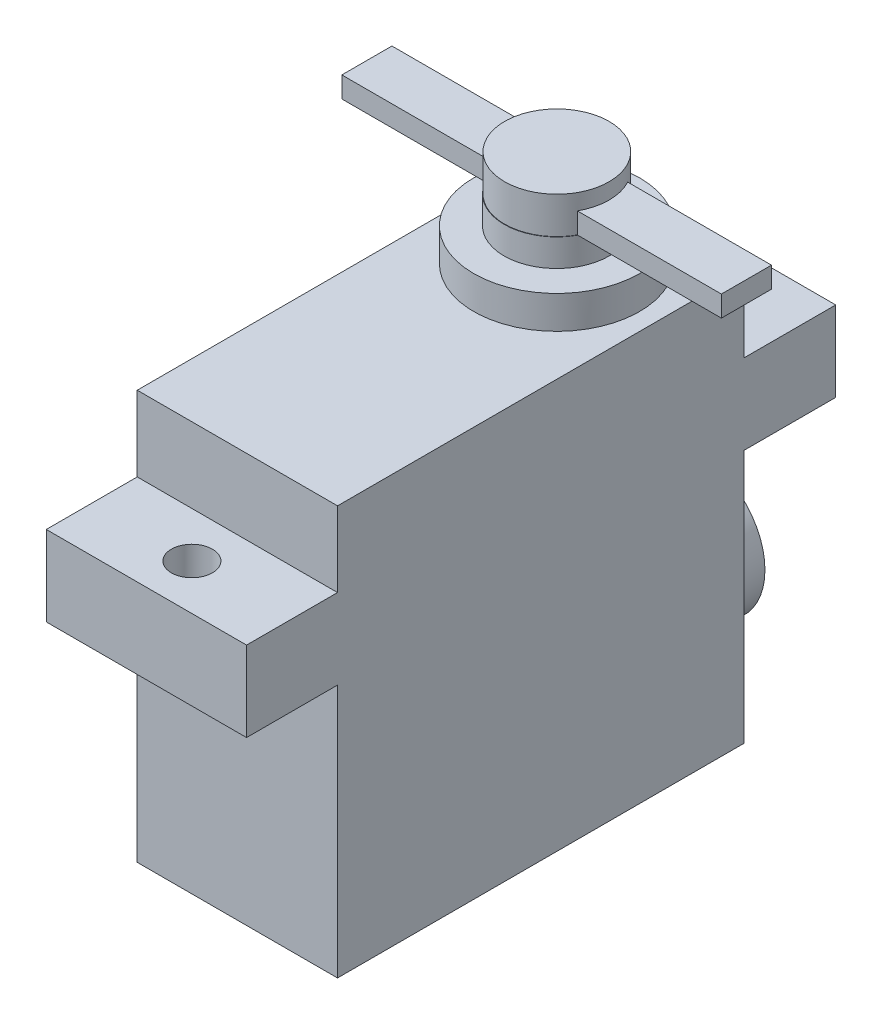
ISO-10303-21;
HEADER;
FILE_DESCRIPTION(('STEP AP214'),'2;1');
FILE_NAME('part.step','',(''),(''),'','','');
FILE_SCHEMA(('AUTOMOTIVE_DESIGN { 1 0 10303 214 1 1 1 1 }'));
ENDSEC;
DATA;
#1=APPLICATION_CONTEXT('core data for automotive mechanical design processes');
#2=APPLICATION_PROTOCOL_DEFINITION('international standard','automotive_design',2000,#1);
#3=PRODUCT_CONTEXT('',#1,'mechanical');
#4=PRODUCT('Part','Part','',(#3));
#5=PRODUCT_RELATED_PRODUCT_CATEGORY('part','',(#4));
#6=PRODUCT_DEFINITION_FORMATION('','',#4);
#7=PRODUCT_DEFINITION_CONTEXT('part definition',#1,'design');
#8=PRODUCT_DEFINITION('design','',#6,#7);
#9=PRODUCT_DEFINITION_SHAPE('','',#8);
#10=(LENGTH_UNIT() NAMED_UNIT(*) SI_UNIT(.MILLI.,.METRE.));
#11=(NAMED_UNIT(*) PLANE_ANGLE_UNIT() SI_UNIT($,.RADIAN.));
#12=(NAMED_UNIT(*) SI_UNIT($,.STERADIAN.) SOLID_ANGLE_UNIT());
#13=UNCERTAINTY_MEASURE_WITH_UNIT(LENGTH_MEASURE(1.E-05),#10,'distance_accuracy_value','');
#14=(GEOMETRIC_REPRESENTATION_CONTEXT(3) GLOBAL_UNCERTAINTY_ASSIGNED_CONTEXT((#13)) GLOBAL_UNIT_ASSIGNED_CONTEXT((#10,
#11,#12)) REPRESENTATION_CONTEXT('',''));
#15=CARTESIAN_POINT('',(0.,0.,0.));
#16=DIRECTION('',(0.,0.,1.));
#17=DIRECTION('',(1.,0.,0.));
#18=AXIS2_PLACEMENT_3D('',#15,#16,#17);
#19=CARTESIAN_POINT('',(7.61999999999996,35.6997,-24.2951));
#20=DIRECTION('',(0.,1.,0.));
#21=DIRECTION('',(0.,0.,1.));
#22=AXIS2_PLACEMENT_3D('',#19,#20,#21);
#23=PLANE('',#22);
#24=DIRECTION('',(-1.,0.,0.));
#25=VECTOR('',#24,1.);
#26=CARTESIAN_POINT('',(0.,35.6997,-26.2001));
#27=LINE('',#26,#25);
#28=CARTESIAN_POINT('',(4.11933293431493,35.6997,-26.2001));
#29=VERTEX_POINT('',#28);
#30=CARTESIAN_POINT('',(4.10941468947124,35.6997,-26.2001));
#31=VERTEX_POINT('',#30);
#32=EDGE_CURVE('E272',#29,#31,#27,.T.);
#33=ORIENTED_EDGE('',*,*,#32,.F.);
#34=CARTESIAN_POINT('',(7.61957047185547,35.6997,-24.3124525424171));
#35=DIRECTION('',(0.,1.,0.));
#36=DIRECTION('',(0.,0.,1.));
#37=AXIS2_PLACEMENT_3D('',#34,#35,#36);
#38=CIRCLE('',#37,3.97679214233372);
#39=CARTESIAN_POINT('',(7.52116292740224,35.6997,-28.2880269284048));
#40=VERTEX_POINT('',#39);
#41=EDGE_CURVE('E201',#40,#29,#38,.T.);
#42=ORIENTED_EDGE('',*,*,#41,.F.);
#43=CARTESIAN_POINT('',(7.61999999999996,35.6997,-24.2951));
#44=DIRECTION('',(0.,1.,0.));
#45=DIRECTION('',(0.,0.,1.));
#46=AXIS2_PLACEMENT_3D('',#43,#44,#45);
#47=CIRCLE('',#46,3.99415);
#48=EDGE_CURVE('E268',#40,#31,#47,.T.);
#49=ORIENTED_EDGE('',*,*,#48,.T.);
#50=EDGE_LOOP('',(#33,#42,#49));
#51=FACE_BOUND('',#50,.T.);
#52=ADVANCED_FACE('F45',(#51),#23,.T.);
#53=CARTESIAN_POINT('',(0.,37.2872,-22.3901));
#54=DIRECTION('',(0.,0.,1.));
#55=DIRECTION('',(1.,0.,0.));
#56=AXIS2_PLACEMENT_3D('',#53,#54,#55);
#57=PLANE('',#56);
#58=DIRECTION('',(-1.,0.,0.));
#59=VECTOR('',#58,1.);
#60=CARTESIAN_POINT('',(0.,35.6997,-22.3901));
#61=LINE('',#60,#59);
#62=CARTESIAN_POINT('',(4.13827237402043,35.6997,-22.3901));
#63=VERTEX_POINT('',#62);
#64=CARTESIAN_POINT('',(4.10941468947124,35.6997,-22.3901));
#65=VERTEX_POINT('',#64);
#66=EDGE_CURVE('E68',#63,#65,#61,.T.);
#67=ORIENTED_EDGE('',*,*,#66,.F.);
#68=DIRECTION('',(0.,-1.,0.));
#69=VECTOR('',#68,1.);
#70=CARTESIAN_POINT('',(4.13827237402043,38.4937,-22.3901));
#71=LINE('',#70,#69);
#72=CARTESIAN_POINT('',(4.13827237402043,37.2872,-22.3901));
#73=VERTEX_POINT('',#72);
#74=EDGE_CURVE('E199',#63,#73,#71,.F.);
#75=ORIENTED_EDGE('',*,*,#74,.T.);
#76=DIRECTION('',(-1.,0.,0.));
#77=VECTOR('',#76,1.);
#78=CARTESIAN_POINT('',(0.,37.2872,-22.3901));
#79=LINE('',#78,#77);
#80=CARTESIAN_POINT('',(-6.81990000000004,37.2872,-22.3901));
#81=VERTEX_POINT('',#80);
#82=EDGE_CURVE('E238',#73,#81,#79,.T.);
#83=ORIENTED_EDGE('',*,*,#82,.T.);
#84=DIRECTION('',(0.,-1.,0.));
#85=VECTOR('',#84,1.);
#86=CARTESIAN_POINT('',(-6.81990000000004,37.2872,-22.3901));
#87=LINE('',#86,#85);
#88=CARTESIAN_POINT('',(-6.81990000000004,35.6997,-22.3901));
#89=VERTEX_POINT('',#88);
#90=EDGE_CURVE('E246',#81,#89,#87,.T.);
#91=ORIENTED_EDGE('',*,*,#90,.T.);
#92=EDGE_CURVE('E221',#65,#89,#61,.T.);
#93=ORIENTED_EDGE('',*,*,#92,.F.);
#94=EDGE_LOOP('',(#67,#75,#83,#91,#93));
#95=FACE_BOUND('',#94,.T.);
#96=ADVANCED_FACE('F452',(#95),#57,.T.);
#97=CARTESIAN_POINT('',(22.0599,37.2872,-22.3901));
#98=VERTEX_POINT('',#97);
#99=CARTESIAN_POINT('',(11.1008685696905,37.2872,-22.3901));
#100=VERTEX_POINT('',#99);
#101=EDGE_CURVE('E212',#98,#100,#79,.T.);
#102=ORIENTED_EDGE('',*,*,#101,.T.);
#103=DIRECTION('',(0.,-1.,0.));
#104=VECTOR('',#103,1.);
#105=CARTESIAN_POINT('',(11.1008685696905,38.4937,-22.3901));
#106=LINE('',#105,#104);
#107=CARTESIAN_POINT('',(11.1008685696905,35.6997,-22.3901));
#108=VERTEX_POINT('',#107);
#109=EDGE_CURVE('E60',#100,#108,#106,.T.);
#110=ORIENTED_EDGE('',*,*,#109,.T.);
#111=CARTESIAN_POINT('',(11.1305853105287,35.6997,-22.3901));
#112=VERTEX_POINT('',#111);
#113=EDGE_CURVE('E209',#112,#108,#61,.T.);
#114=ORIENTED_EDGE('',*,*,#113,.F.);
#115=CARTESIAN_POINT('',(22.0599,35.6997,-22.3901));
#116=VERTEX_POINT('',#115);
#117=EDGE_CURVE('E220',#116,#112,#61,.T.);
#118=ORIENTED_EDGE('',*,*,#117,.F.);
#119=DIRECTION('',(0.,-1.,0.));
#120=VECTOR('',#119,1.);
#121=CARTESIAN_POINT('',(22.0599,37.2872,-22.3901));
#122=LINE('',#121,#120);
#123=EDGE_CURVE('E261',#98,#116,#122,.T.);
#124=ORIENTED_EDGE('',*,*,#123,.F.);
#125=EDGE_LOOP('',(#102,#110,#114,#118,#124));
#126=FACE_BOUND('',#125,.T.);
#127=ADVANCED_FACE('F207',(#126),#57,.T.);
#128=CARTESIAN_POINT('',(0.,37.2872,-26.2001));
#129=DIRECTION('',(0.,0.,1.));
#130=DIRECTION('',(1.,0.,0.));
#131=AXIS2_PLACEMENT_3D('',#128,#129,#130);
#132=PLANE('',#131);
#133=DIRECTION('',(0.,-1.,0.));
#134=VECTOR('',#133,1.);
#135=CARTESIAN_POINT('',(4.11933293431493,38.4937,-26.2001));
#136=LINE('',#135,#134);
#137=CARTESIAN_POINT('',(4.11933293431493,37.2872,-26.2001));
#138=VERTEX_POINT('',#137);
#139=EDGE_CURVE('E213',#29,#138,#136,.F.);
#140=ORIENTED_EDGE('',*,*,#139,.F.);
#141=ORIENTED_EDGE('',*,*,#32,.T.);
#142=CARTESIAN_POINT('',(-6.81990000000004,35.6997,-26.2001));
#143=VERTEX_POINT('',#142);
#144=EDGE_CURVE('E485',#31,#143,#27,.T.);
#145=ORIENTED_EDGE('',*,*,#144,.T.);
#146=DIRECTION('',(0.,-1.,0.));
#147=VECTOR('',#146,1.);
#148=CARTESIAN_POINT('',(-6.81990000000004,37.2872,-26.2001));
#149=LINE('',#148,#147);
#150=CARTESIAN_POINT('',(-6.81990000000004,37.2872,-26.2001));
#151=VERTEX_POINT('',#150);
#152=EDGE_CURVE('E250',#151,#143,#149,.T.);
#153=ORIENTED_EDGE('',*,*,#152,.F.);
#154=DIRECTION('',(-1.,0.,0.));
#155=VECTOR('',#154,1.);
#156=CARTESIAN_POINT('',(0.,37.2872,-26.2001));
#157=LINE('',#156,#155);
#158=EDGE_CURVE('E241',#138,#151,#157,.T.);
#159=ORIENTED_EDGE('',*,*,#158,.F.);
#160=EDGE_LOOP('',(#140,#141,#145,#153,#159));
#161=FACE_BOUND('',#160,.T.);
#162=ADVANCED_FACE('F499',(#161),#132,.F.);
#163=DIRECTION('',(0.,-1.,0.));
#164=VECTOR('',#163,1.);
#165=CARTESIAN_POINT('',(11.119808009396,38.4937,-26.2001));
#166=LINE('',#165,#164);
#167=CARTESIAN_POINT('',(11.119808009396,37.2872,-26.2001));
#168=VERTEX_POINT('',#167);
#169=CARTESIAN_POINT('',(11.119808009396,35.6997,-26.2001));
#170=VERTEX_POINT('',#169);
#171=EDGE_CURVE('E214',#168,#170,#166,.T.);
#172=ORIENTED_EDGE('',*,*,#171,.F.);
#173=CARTESIAN_POINT('',(22.0599,37.2872,-26.2001));
#174=VERTEX_POINT('',#173);
#175=EDGE_CURVE('E242',#174,#168,#157,.T.);
#176=ORIENTED_EDGE('',*,*,#175,.F.);
#177=DIRECTION('',(0.,-1.,0.));
#178=VECTOR('',#177,1.);
#179=CARTESIAN_POINT('',(22.0599,37.2872,-26.2001));
#180=LINE('',#179,#178);
#181=CARTESIAN_POINT('',(22.0599,35.6997,-26.2001));
#182=VERTEX_POINT('',#181);
#183=EDGE_CURVE('E254',#174,#182,#180,.T.);
#184=ORIENTED_EDGE('',*,*,#183,.T.);
#185=CARTESIAN_POINT('',(11.1305853105287,35.6997,-26.2001));
#186=VERTEX_POINT('',#185);
#187=EDGE_CURVE('E490',#182,#186,#27,.T.);
#188=ORIENTED_EDGE('',*,*,#187,.T.);
#189=EDGE_CURVE('E222',#186,#170,#27,.T.);
#190=ORIENTED_EDGE('',*,*,#189,.T.);
#191=EDGE_LOOP('',(#172,#176,#184,#188,#190));
#192=FACE_BOUND('',#191,.T.);
#193=ADVANCED_FACE('F494',(#192),#132,.F.);
#194=CARTESIAN_POINT('',(0.,37.2872,0.));
#195=DIRECTION('',(0.,1.,0.));
#196=DIRECTION('',(0.,0.,1.));
#197=AXIS2_PLACEMENT_3D('',#194,#195,#196);
#198=PLANE('',#197);
#199=ORIENTED_EDGE('',*,*,#82,.F.);
#200=CARTESIAN_POINT('',(7.61957047185547,37.2872,-24.3124525424171));
#201=DIRECTION('',(0.,1.,0.));
#202=DIRECTION('',(0.,0.,1.));
#203=AXIS2_PLACEMENT_3D('',#200,#201,#202);
#204=CIRCLE('',#203,3.97679214233372);
#205=EDGE_CURVE('E11',#73,#138,#204,.F.);
#206=ORIENTED_EDGE('',*,*,#205,.T.);
#207=ORIENTED_EDGE('',*,*,#158,.T.);
#208=DIRECTION('',(0.,0.,1.));
#209=VECTOR('',#208,1.);
#210=CARTESIAN_POINT('',(-6.81990000000003,37.2872,0.));
#211=LINE('',#210,#209);
#212=EDGE_CURVE('E244',#151,#81,#211,.T.);
#213=ORIENTED_EDGE('',*,*,#212,.T.);
#214=EDGE_LOOP('',(#199,#206,#207,#213));
#215=FACE_BOUND('',#214,.T.);
#216=ADVANCED_FACE('F463',(#215),#198,.T.);
#217=ORIENTED_EDGE('',*,*,#113,.T.);
#218=EDGE_CURVE('E195',#63,#108,#38,.T.);
#219=ORIENTED_EDGE('',*,*,#218,.F.);
#220=ORIENTED_EDGE('',*,*,#66,.T.);
#221=EDGE_CURVE('E217',#65,#112,#47,.T.);
#222=ORIENTED_EDGE('',*,*,#221,.T.);
#223=EDGE_LOOP('',(#217,#219,#220,#222));
#224=FACE_BOUND('',#223,.T.);
#225=ADVANCED_FACE('F216',(#224),#23,.T.);
#226=CARTESIAN_POINT('',(0.,31.115,0.));
#227=DIRECTION('',(0.,0.,-1.));
#228=DIRECTION('',(-1.,0.,0.));
#229=AXIS2_PLACEMENT_3D('',#226,#227,#228);
#230=PLANE('',#229);
#231=DIRECTION('',(0.,-1.,0.));
#232=VECTOR('',#231,1.);
#233=CARTESIAN_POINT('',(0.,31.115,0.));
#234=LINE('',#233,#232);
#235=CARTESIAN_POINT('',(0.,31.115,0.));
#236=VERTEX_POINT('',#235);
#237=CARTESIAN_POINT('',(0.,25.4,0.));
#238=VERTEX_POINT('',#237);
#239=EDGE_CURVE('E369',#236,#238,#234,.T.);
#240=ORIENTED_EDGE('',*,*,#239,.T.);
#241=DIRECTION('',(1.,0.,0.));
#242=VECTOR('',#241,1.);
#243=CARTESIAN_POINT('',(0.,25.4,0.));
#244=LINE('',#243,#242);
#245=CARTESIAN_POINT('',(15.2399999999999,25.4,0.));
#246=VERTEX_POINT('',#245);
#247=EDGE_CURVE('E332',#238,#246,#244,.T.);
#248=ORIENTED_EDGE('',*,*,#247,.T.);
#249=DIRECTION('',(0.,-1.,0.));
#250=VECTOR('',#249,1.);
#251=CARTESIAN_POINT('',(15.2399999999999,31.115,0.));
#252=LINE('',#251,#250);
#253=CARTESIAN_POINT('',(15.2399999999999,31.115,0.));
#254=VERTEX_POINT('',#253);
#255=EDGE_CURVE('E365',#254,#246,#252,.T.);
#256=ORIENTED_EDGE('',*,*,#255,.F.);
#257=DIRECTION('',(1.,0.,0.));
#258=VECTOR('',#257,1.);
#259=CARTESIAN_POINT('',(0.,31.115,0.));
#260=LINE('',#259,#258);
#261=EDGE_CURVE('E339',#236,#254,#260,.T.);
#262=ORIENTED_EDGE('',*,*,#261,.F.);
#263=EDGE_LOOP('',(#240,#248,#256,#262));
#264=FACE_BOUND('',#263,.T.);
#265=ADVANCED_FACE('F401',(#264),#230,.F.);
#266=CARTESIAN_POINT('',(0.,31.115,-30.9117999999999));
#267=DIRECTION('',(0.,0.,1.));
#268=DIRECTION('',(1.,0.,0.));
#269=AXIS2_PLACEMENT_3D('',#266,#267,#268);
#270=PLANE('',#269);
#271=DIRECTION('',(0.,-1.,0.));
#272=VECTOR('',#271,1.);
#273=CARTESIAN_POINT('',(15.2399999999999,31.115,-30.9118));
#274=LINE('',#273,#272);
#275=CARTESIAN_POINT('',(15.2399999999999,31.115,-30.9118));
#276=VERTEX_POINT('',#275);
#277=CARTESIAN_POINT('',(15.2399999999999,25.4,-30.9118));
#278=VERTEX_POINT('',#277);
#279=EDGE_CURVE('E361',#276,#278,#274,.T.);
#280=ORIENTED_EDGE('',*,*,#279,.T.);
#281=DIRECTION('',(-1.,0.,0.));
#282=VECTOR('',#281,1.);
#283=CARTESIAN_POINT('',(0.,25.4,-30.9117999999999));
#284=LINE('',#283,#282);
#285=CARTESIAN_POINT('',(0.,25.4,-30.9118));
#286=VERTEX_POINT('',#285);
#287=EDGE_CURVE('E375',#278,#286,#284,.T.);
#288=ORIENTED_EDGE('',*,*,#287,.T.);
#289=DIRECTION('',(0.,-1.,0.));
#290=VECTOR('',#289,1.);
#291=CARTESIAN_POINT('',(0.,31.115,-30.9117999999999));
#292=LINE('',#291,#290);
#293=CARTESIAN_POINT('',(0.,31.115,-30.9117999999999));
#294=VERTEX_POINT('',#293);
#295=EDGE_CURVE('E357',#294,#286,#292,.T.);
#296=ORIENTED_EDGE('',*,*,#295,.F.);
#297=DIRECTION('',(-1.,0.,0.));
#298=VECTOR('',#297,1.);
#299=CARTESIAN_POINT('',(0.,31.115,-30.9117999999999));
#300=LINE('',#299,#298);
#301=EDGE_CURVE('E344',#276,#294,#300,.T.);
#302=ORIENTED_EDGE('',*,*,#301,.F.);
#303=EDGE_LOOP('',(#280,#288,#296,#302));
#304=FACE_BOUND('',#303,.T.);
#305=ADVANCED_FACE('F408',(#304),#270,.F.);
#306=CARTESIAN_POINT('',(0.,31.115,0.));
#307=DIRECTION('',(1.,0.,0.));
#308=DIRECTION('',(0.,0.,-1.));
#309=AXIS2_PLACEMENT_3D('',#306,#307,#308);
#310=PLANE('',#309);
#311=CARTESIAN_POINT('',(0.,19.304,0.));
#312=VERTEX_POINT('',#311);
#313=CARTESIAN_POINT('',(0.,0.,0.));
#314=VERTEX_POINT('',#313);
#315=EDGE_CURVE('E368',#312,#314,#234,.T.);
#316=ORIENTED_EDGE('',*,*,#315,.F.);
#317=DIRECTION('',(0.,0.,1.));
#318=VECTOR('',#317,1.);
#319=CARTESIAN_POINT('',(0.,19.304,-37.9095));
#320=LINE('',#319,#318);
#321=CARTESIAN_POINT('',(0.,19.304,6.9215));
#322=VERTEX_POINT('',#321);
#323=EDGE_CURVE('E315',#312,#322,#320,.T.);
#324=ORIENTED_EDGE('',*,*,#323,.T.);
#325=DIRECTION('',(0.,-1.,0.));
#326=VECTOR('',#325,1.);
#327=CARTESIAN_POINT('',(0.,25.4,6.9215));
#328=LINE('',#327,#326);
#329=CARTESIAN_POINT('',(0.,25.4,6.9215));
#330=VERTEX_POINT('',#329);
#331=EDGE_CURVE('E291',#330,#322,#328,.T.);
#332=ORIENTED_EDGE('',*,*,#331,.F.);
#333=DIRECTION('',(0.,0.,1.));
#334=VECTOR('',#333,1.);
#335=CARTESIAN_POINT('',(0.,25.4,-37.9095));
#336=LINE('',#335,#334);
#337=EDGE_CURVE('E319',#238,#330,#336,.T.);
#338=ORIENTED_EDGE('',*,*,#337,.F.);
#339=ORIENTED_EDGE('',*,*,#239,.F.);
#340=DIRECTION('',(0.,0.,1.));
#341=VECTOR('',#340,1.);
#342=CARTESIAN_POINT('',(0.,31.115,0.));
#343=LINE('',#342,#341);
#344=EDGE_CURVE('E336',#294,#236,#343,.T.);
#345=ORIENTED_EDGE('',*,*,#344,.F.);
#346=ORIENTED_EDGE('',*,*,#295,.T.);
#347=CARTESIAN_POINT('',(0.,25.4,-37.9095));
#348=VERTEX_POINT('',#347);
#349=EDGE_CURVE('E316',#348,#286,#336,.T.);
#350=ORIENTED_EDGE('',*,*,#349,.F.);
#351=DIRECTION('',(0.,-1.,0.));
#352=VECTOR('',#351,1.);
#353=CARTESIAN_POINT('',(0.,25.4,-37.9095));
#354=LINE('',#353,#352);
#355=CARTESIAN_POINT('',(0.,19.304,-37.9095));
#356=VERTEX_POINT('',#355);
#357=EDGE_CURVE('E303',#348,#356,#354,.T.);
#358=ORIENTED_EDGE('',*,*,#357,.T.);
#359=CARTESIAN_POINT('',(0.,19.304,-30.9118));
#360=VERTEX_POINT('',#359);
#361=EDGE_CURVE('E327',#356,#360,#320,.T.);
#362=ORIENTED_EDGE('',*,*,#361,.T.);
#363=CARTESIAN_POINT('',(0.,0.,-30.9117999999999));
#364=VERTEX_POINT('',#363);
#365=EDGE_CURVE('E346',#360,#364,#292,.T.);
#366=ORIENTED_EDGE('',*,*,#365,.T.);
#367=DIRECTION('',(0.,0.,1.));
#368=VECTOR('',#367,1.);
#369=CARTESIAN_POINT('',(0.,0.,0.));
#370=LINE('',#369,#368);
#371=EDGE_CURVE('E335',#364,#314,#370,.T.);
#372=ORIENTED_EDGE('',*,*,#371,.T.);
#373=EDGE_LOOP('',(#316,#324,#332,#338,#339,#345,#346,#350,#358,#362,#366,#372));
#374=FACE_BOUND('',#373,.T.);
#375=ADVANCED_FACE('F47',(#374),#310,.F.);
#376=CARTESIAN_POINT('',(15.2399999999999,19.304,0.));
#377=VERTEX_POINT('',#376);
#378=CARTESIAN_POINT('',(15.2399999999999,0.,0.));
#379=VERTEX_POINT('',#378);
#380=EDGE_CURVE('E364',#377,#379,#252,.T.);
#381=ORIENTED_EDGE('',*,*,#380,.F.);
#382=DIRECTION('',(-1.,0.,0.));
#383=VECTOR('',#382,1.);
#384=CARTESIAN_POINT('',(0.,19.304,0.));
#385=LINE('',#384,#383);
#386=EDGE_CURVE('E318',#377,#312,#385,.T.);
#387=ORIENTED_EDGE('',*,*,#386,.T.);
#388=ORIENTED_EDGE('',*,*,#315,.T.);
#389=DIRECTION('',(1.,0.,0.));
#390=VECTOR('',#389,1.);
#391=CARTESIAN_POINT('',(0.,0.,0.));
#392=LINE('',#391,#390);
#393=EDGE_CURVE('E349',#314,#379,#392,.T.);
#394=ORIENTED_EDGE('',*,*,#393,.T.);
#395=EDGE_LOOP('',(#381,#387,#388,#394));
#396=FACE_BOUND('',#395,.T.);
#397=ADVANCED_FACE('F429',(#396),#230,.F.);
#398=CARTESIAN_POINT('',(15.2399999999999,31.115,0.));
#399=DIRECTION('',(-1.,0.,0.));
#400=DIRECTION('',(0.,0.,1.));
#401=AXIS2_PLACEMENT_3D('',#398,#399,#400);
#402=PLANE('',#401);
#403=CARTESIAN_POINT('',(15.2399999999999,19.304,-30.9118));
#404=VERTEX_POINT('',#403);
#405=CARTESIAN_POINT('',(15.2399999999999,0.,-30.9118));
#406=VERTEX_POINT('',#405);
#407=EDGE_CURVE('E360',#404,#406,#274,.T.);
#408=ORIENTED_EDGE('',*,*,#407,.F.);
#409=DIRECTION('',(0.,0.,1.));
#410=VECTOR('',#409,1.);
#411=CARTESIAN_POINT('',(15.2399999999999,19.304,-37.9095));
#412=LINE('',#411,#410);
#413=CARTESIAN_POINT('',(15.2399999999999,19.304,-37.9095));
#414=VERTEX_POINT('',#413);
#415=EDGE_CURVE('E324',#414,#404,#412,.T.);
#416=ORIENTED_EDGE('',*,*,#415,.F.);
#417=DIRECTION('',(0.,1.,0.));
#418=VECTOR('',#417,1.);
#419=CARTESIAN_POINT('',(15.2399999999999,25.4,-37.9095));
#420=LINE('',#419,#418);
#421=CARTESIAN_POINT('',(15.2399999999999,25.4,-37.9095));
#422=VERTEX_POINT('',#421);
#423=EDGE_CURVE('E309',#414,#422,#420,.T.);
#424=ORIENTED_EDGE('',*,*,#423,.T.);
#425=DIRECTION('',(0.,0.,1.));
#426=VECTOR('',#425,1.);
#427=CARTESIAN_POINT('',(15.2399999999999,25.4,-37.9095));
#428=LINE('',#427,#426);
#429=EDGE_CURVE('E320',#422,#278,#428,.T.);
#430=ORIENTED_EDGE('',*,*,#429,.T.);
#431=ORIENTED_EDGE('',*,*,#279,.F.);
#432=DIRECTION('',(0.,0.,-1.));
#433=VECTOR('',#432,1.);
#434=CARTESIAN_POINT('',(15.2399999999999,31.115,0.));
#435=LINE('',#434,#433);
#436=EDGE_CURVE('E342',#254,#276,#435,.T.);
#437=ORIENTED_EDGE('',*,*,#436,.F.);
#438=ORIENTED_EDGE('',*,*,#255,.T.);
#439=CARTESIAN_POINT('',(15.2399999999999,25.4,6.9215));
#440=VERTEX_POINT('',#439);
#441=EDGE_CURVE('E323',#246,#440,#428,.T.);
#442=ORIENTED_EDGE('',*,*,#441,.T.);
#443=DIRECTION('',(0.,1.,0.));
#444=VECTOR('',#443,1.);
#445=CARTESIAN_POINT('',(15.2399999999999,25.4,6.9215));
#446=LINE('',#445,#444);
#447=CARTESIAN_POINT('',(15.2399999999999,19.304,6.9215));
#448=VERTEX_POINT('',#447);
#449=EDGE_CURVE('E297',#448,#440,#446,.T.);
#450=ORIENTED_EDGE('',*,*,#449,.F.);
#451=EDGE_CURVE('E326',#377,#448,#412,.T.);
#452=ORIENTED_EDGE('',*,*,#451,.F.);
#453=ORIENTED_EDGE('',*,*,#380,.T.);
#454=DIRECTION('',(0.,0.,-1.));
#455=VECTOR('',#454,1.);
#456=CARTESIAN_POINT('',(15.2399999999999,0.,0.));
#457=LINE('',#456,#455);
#458=EDGE_CURVE('E352',#379,#406,#457,.T.);
#459=ORIENTED_EDGE('',*,*,#458,.T.);
#460=EDGE_LOOP('',(#408,#416,#424,#430,#431,#437,#438,#442,#450,#452,#453,#459));
#461=FACE_BOUND('',#460,.T.);
#462=ADVANCED_FACE('F406',(#461),#402,.F.);
#463=CARTESIAN_POINT('',(7.61999999999996,8.2804,-30.9118));
#464=DIRECTION('',(0.,0.,1.));
#465=DIRECTION('',(1.,0.,0.));
#466=AXIS2_PLACEMENT_3D('',#463,#464,#465);
#467=CIRCLE('',#466,5.2705);
#468=CARTESIAN_POINT('',(12.8905,8.2804,-30.9118));
#469=VERTEX_POINT('',#468);
#470=EDGE_CURVE('E378',#469,#469,#467,.F.);
#471=ORIENTED_EDGE('',*,*,#470,.F.);
#472=EDGE_LOOP('',(#471));
#473=FACE_BOUND('',#472,.T.);
#474=ORIENTED_EDGE('',*,*,#365,.F.);
#475=DIRECTION('',(1.,0.,0.));
#476=VECTOR('',#475,1.);
#477=CARTESIAN_POINT('',(0.,19.304,-30.9117999999999));
#478=LINE('',#477,#476);
#479=EDGE_CURVE('E372',#360,#404,#478,.T.);
#480=ORIENTED_EDGE('',*,*,#479,.T.);
#481=ORIENTED_EDGE('',*,*,#407,.T.);
#482=DIRECTION('',(-1.,0.,0.));
#483=VECTOR('',#482,1.);
#484=CARTESIAN_POINT('',(0.,0.,-30.9117999999999));
#485=LINE('',#484,#483);
#486=EDGE_CURVE('E340',#406,#364,#485,.T.);
#487=ORIENTED_EDGE('',*,*,#486,.T.);
#488=EDGE_LOOP('',(#474,#480,#481,#487));
#489=FACE_BOUND('',#488,.T.);
#490=ADVANCED_FACE('F389',(#473,#489),#270,.F.);
#491=CARTESIAN_POINT('',(0.,31.115,0.));
#492=DIRECTION('',(0.,-1.,0.));
#493=DIRECTION('',(0.,0.,-1.));
#494=AXIS2_PLACEMENT_3D('',#491,#492,#493);
#495=PLANE('',#494);
#496=CARTESIAN_POINT('',(7.61999999999996,31.115,-24.2951));
#497=DIRECTION('',(0.,-1.,0.));
#498=DIRECTION('',(0.,0.,-1.));
#499=AXIS2_PLACEMENT_3D('',#496,#497,#498);
#500=CIRCLE('',#499,6.3119);
#501=CARTESIAN_POINT('',(7.61999999999996,31.115,-30.607));
#502=VERTEX_POINT('',#501);
#503=EDGE_CURVE('E273',#502,#502,#500,.F.);
#504=ORIENTED_EDGE('',*,*,#503,.F.);
#505=EDGE_LOOP('',(#504));
#506=FACE_BOUND('',#505,.T.);
#507=ORIENTED_EDGE('',*,*,#344,.T.);
#508=ORIENTED_EDGE('',*,*,#261,.T.);
#509=ORIENTED_EDGE('',*,*,#436,.T.);
#510=ORIENTED_EDGE('',*,*,#301,.T.);
#511=EDGE_LOOP('',(#507,#508,#509,#510));
#512=FACE_BOUND('',#511,.T.);
#513=ADVANCED_FACE('F385',(#506,#512),#495,.F.);
#514=CARTESIAN_POINT('',(0.,0.,0.));
#515=DIRECTION('',(0.,-1.,0.));
#516=DIRECTION('',(0.,0.,-1.));
#517=AXIS2_PLACEMENT_3D('',#514,#515,#516);
#518=PLANE('',#517);
#519=ORIENTED_EDGE('',*,*,#371,.F.);
#520=ORIENTED_EDGE('',*,*,#486,.F.);
#521=ORIENTED_EDGE('',*,*,#458,.F.);
#522=ORIENTED_EDGE('',*,*,#393,.F.);
#523=EDGE_LOOP('',(#519,#520,#521,#522));
#524=FACE_BOUND('',#523,.T.);
#525=ADVANCED_FACE('F388',(#524),#518,.T.);
#526=CARTESIAN_POINT('',(0.,0.,-37.9095));
#527=DIRECTION('',(0.,0.,1.));
#528=DIRECTION('',(1.,0.,0.));
#529=AXIS2_PLACEMENT_3D('',#526,#527,#528);
#530=PLANE('',#529);
#531=ORIENTED_EDGE('',*,*,#357,.F.);
#532=DIRECTION('',(-1.,0.,0.));
#533=VECTOR('',#532,1.);
#534=CARTESIAN_POINT('',(0.,25.4,-37.9095));
#535=LINE('',#534,#533);
#536=EDGE_CURVE('E312',#422,#348,#535,.T.);
#537=ORIENTED_EDGE('',*,*,#536,.F.);
#538=ORIENTED_EDGE('',*,*,#423,.F.);
#539=DIRECTION('',(1.,0.,0.));
#540=VECTOR('',#539,1.);
#541=CARTESIAN_POINT('',(0.,19.304,-37.9095));
#542=LINE('',#541,#540);
#543=EDGE_CURVE('E306',#356,#414,#542,.T.);
#544=ORIENTED_EDGE('',*,*,#543,.F.);
#545=EDGE_LOOP('',(#531,#537,#538,#544));
#546=FACE_BOUND('',#545,.T.);
#547=ADVANCED_FACE('F414',(#546),#530,.F.);
#548=CARTESIAN_POINT('',(0.,19.304,-37.9095));
#549=DIRECTION('',(0.,-1.,0.));
#550=DIRECTION('',(0.,0.,-1.));
#551=AXIS2_PLACEMENT_3D('',#548,#549,#550);
#552=PLANE('',#551);
#553=CARTESIAN_POINT('',(7.61999999999996,19.304,-34.41065));
#554=DIRECTION('',(0.,-1.,0.));
#555=DIRECTION('',(0.,0.,-1.));
#556=AXIS2_PLACEMENT_3D('',#553,#554,#555);
#557=CIRCLE('',#556,1.5621);
#558=CARTESIAN_POINT('',(7.61999999999996,19.304,-35.97275));
#559=VERTEX_POINT('',#558);
#560=EDGE_CURVE('E266',#559,#559,#557,.F.);
#561=ORIENTED_EDGE('',*,*,#560,.T.);
#562=EDGE_LOOP('',(#561));
#563=FACE_BOUND('',#562,.T.);
#564=ORIENTED_EDGE('',*,*,#479,.F.);
#565=ORIENTED_EDGE('',*,*,#361,.F.);
#566=ORIENTED_EDGE('',*,*,#543,.T.);
#567=ORIENTED_EDGE('',*,*,#415,.T.);
#568=EDGE_LOOP('',(#564,#565,#566,#567));
#569=FACE_BOUND('',#568,.T.);
#570=ADVANCED_FACE('F418',(#563,#569),#552,.T.);
#571=CARTESIAN_POINT('',(0.,25.4,-37.9095));
#572=DIRECTION('',(0.,1.,0.));
#573=DIRECTION('',(0.,0.,1.));
#574=AXIS2_PLACEMENT_3D('',#571,#572,#573);
#575=PLANE('',#574);
#576=CARTESIAN_POINT('',(7.61999999999996,25.4,-34.41065));
#577=DIRECTION('',(0.,1.,0.));
#578=DIRECTION('',(0.,0.,1.));
#579=AXIS2_PLACEMENT_3D('',#576,#577,#578);
#580=CIRCLE('',#579,1.5621);
#581=CARTESIAN_POINT('',(7.61999999999996,25.4,-32.84855));
#582=VERTEX_POINT('',#581);
#583=EDGE_CURVE('E276',#582,#582,#580,.T.);
#584=ORIENTED_EDGE('',*,*,#583,.F.);
#585=EDGE_LOOP('',(#584));
#586=FACE_BOUND('',#585,.T.);
#587=ORIENTED_EDGE('',*,*,#287,.F.);
#588=ORIENTED_EDGE('',*,*,#429,.F.);
#589=ORIENTED_EDGE('',*,*,#536,.T.);
#590=ORIENTED_EDGE('',*,*,#349,.T.);
#591=EDGE_LOOP('',(#587,#588,#589,#590));
#592=FACE_BOUND('',#591,.T.);
#593=ADVANCED_FACE('F416',(#586,#592),#575,.T.);
#594=CARTESIAN_POINT('',(7.61999999999996,25.4,3.46075));
#595=DIRECTION('',(0.,1.,0.));
#596=DIRECTION('',(0.,0.,1.));
#597=AXIS2_PLACEMENT_3D('',#594,#595,#596);
#598=CIRCLE('',#597,1.5621);
#599=CARTESIAN_POINT('',(7.61999999999996,25.4,5.02285));
#600=VERTEX_POINT('',#599);
#601=EDGE_CURVE('E280',#600,#600,#598,.T.);
#602=ORIENTED_EDGE('',*,*,#601,.F.);
#603=EDGE_LOOP('',(#602));
#604=FACE_BOUND('',#603,.T.);
#605=ORIENTED_EDGE('',*,*,#247,.F.);
#606=ORIENTED_EDGE('',*,*,#337,.T.);
#607=DIRECTION('',(-1.,0.,0.));
#608=VECTOR('',#607,1.);
#609=CARTESIAN_POINT('',(0.,25.4,6.9215));
#610=LINE('',#609,#608);
#611=EDGE_CURVE('E300',#440,#330,#610,.T.);
#612=ORIENTED_EDGE('',*,*,#611,.F.);
#613=ORIENTED_EDGE('',*,*,#441,.F.);
#614=EDGE_LOOP('',(#605,#606,#612,#613));
#615=FACE_BOUND('',#614,.T.);
#616=ADVANCED_FACE('F438',(#604,#615),#575,.T.);
#617=CARTESIAN_POINT('',(7.61999999999996,19.304,3.46075));
#618=DIRECTION('',(0.,-1.,0.));
#619=DIRECTION('',(0.,0.,-1.));
#620=AXIS2_PLACEMENT_3D('',#617,#618,#619);
#621=CIRCLE('',#620,1.5621);
#622=CARTESIAN_POINT('',(7.61999999999996,19.304,1.89865));
#623=VERTEX_POINT('',#622);
#624=EDGE_CURVE('E279',#623,#623,#621,.F.);
#625=ORIENTED_EDGE('',*,*,#624,.T.);
#626=EDGE_LOOP('',(#625));
#627=FACE_BOUND('',#626,.T.);
#628=ORIENTED_EDGE('',*,*,#386,.F.);
#629=ORIENTED_EDGE('',*,*,#451,.T.);
#630=DIRECTION('',(1.,0.,0.));
#631=VECTOR('',#630,1.);
#632=CARTESIAN_POINT('',(0.,19.304,6.9215));
#633=LINE('',#632,#631);
#634=EDGE_CURVE('E294',#322,#448,#633,.T.);
#635=ORIENTED_EDGE('',*,*,#634,.F.);
#636=ORIENTED_EDGE('',*,*,#323,.F.);
#637=EDGE_LOOP('',(#628,#629,#635,#636));
#638=FACE_BOUND('',#637,.T.);
#639=ADVANCED_FACE('F432',(#627,#638),#552,.T.);
#640=CARTESIAN_POINT('',(0.,0.,6.9215));
#641=DIRECTION('',(0.,0.,1.));
#642=DIRECTION('',(1.,0.,0.));
#643=AXIS2_PLACEMENT_3D('',#640,#641,#642);
#644=PLANE('',#643);
#645=ORIENTED_EDGE('',*,*,#331,.T.);
#646=ORIENTED_EDGE('',*,*,#634,.T.);
#647=ORIENTED_EDGE('',*,*,#449,.T.);
#648=ORIENTED_EDGE('',*,*,#611,.T.);
#649=EDGE_LOOP('',(#645,#646,#647,#648));
#650=FACE_BOUND('',#649,.T.);
#651=ADVANCED_FACE('F436',(#650),#644,.T.);
#652=CARTESIAN_POINT('',(7.61999999999994,8.2804,-34.8742));
#653=DIRECTION('',(0.,0.,1.));
#654=DIRECTION('',(1.,0.,0.));
#655=AXIS2_PLACEMENT_3D('',#652,#653,#654);
#656=CYLINDRICAL_SURFACE('',#655,5.2705);
#657=CARTESIAN_POINT('',(7.61999999999994,8.2804,-34.8742));
#658=DIRECTION('',(0.,0.,-1.));
#659=DIRECTION('',(-1.,0.,0.));
#660=AXIS2_PLACEMENT_3D('',#657,#658,#659);
#661=CIRCLE('',#660,5.2705);
#662=CARTESIAN_POINT('',(2.34949999999994,8.2804,-34.8741999999999));
#663=VERTEX_POINT('',#662);
#664=EDGE_CURVE('E288',#663,#663,#661,.T.);
#665=ORIENTED_EDGE('',*,*,#664,.F.);
#666=EDGE_LOOP('',(#665));
#667=FACE_BOUND('',#666,.T.);
#668=ORIENTED_EDGE('',*,*,#470,.T.);
#669=EDGE_LOOP('',(#668));
#670=FACE_BOUND('',#669,.T.);
#671=ADVANCED_FACE('F629',(#667,#670),#656,.T.);
#672=CARTESIAN_POINT('',(7.61999999999994,8.2804,-34.8742));
#673=DIRECTION('',(0.,0.,-1.));
#674=DIRECTION('',(-1.,0.,0.));
#675=AXIS2_PLACEMENT_3D('',#672,#673,#674);
#676=PLANE('',#675);
#677=ORIENTED_EDGE('',*,*,#664,.T.);
#678=EDGE_LOOP('',(#677));
#679=FACE_BOUND('',#678,.T.);
#680=ADVANCED_FACE('F609',(#679),#676,.T.);
#681=CARTESIAN_POINT('',(7.61999999999996,33.6169,-24.2951));
#682=DIRECTION('',(0.,-1.,0.));
#683=DIRECTION('',(0.,0.,-1.));
#684=AXIS2_PLACEMENT_3D('',#681,#682,#683);
#685=CYLINDRICAL_SURFACE('',#684,6.3119);
#686=CARTESIAN_POINT('',(7.61999999999996,33.6169,-24.2951));
#687=DIRECTION('',(0.,1.,0.));
#688=DIRECTION('',(0.,0.,1.));
#689=AXIS2_PLACEMENT_3D('',#686,#687,#688);
#690=CIRCLE('',#689,6.3119);
#691=CARTESIAN_POINT('',(7.61999999999996,33.6169,-17.9832));
#692=VERTEX_POINT('',#691);
#693=EDGE_CURVE('E283',#692,#692,#690,.T.);
#694=ORIENTED_EDGE('',*,*,#693,.F.);
#695=EDGE_LOOP('',(#694));
#696=FACE_BOUND('',#695,.T.);
#697=ORIENTED_EDGE('',*,*,#503,.T.);
#698=EDGE_LOOP('',(#697));
#699=FACE_BOUND('',#698,.T.);
#700=ADVANCED_FACE('F383',(#696,#699),#685,.T.);
#701=CARTESIAN_POINT('',(7.61999999999996,33.6169,-24.2951));
#702=DIRECTION('',(0.,1.,0.));
#703=DIRECTION('',(0.,0.,1.));
#704=AXIS2_PLACEMENT_3D('',#701,#702,#703);
#705=PLANE('',#704);
#706=CARTESIAN_POINT('',(7.61999999999996,33.6169,-24.2951));
#707=DIRECTION('',(0.,1.,0.));
#708=DIRECTION('',(0.,0.,1.));
#709=AXIS2_PLACEMENT_3D('',#706,#707,#708);
#710=CIRCLE('',#709,3.99415);
#711=CARTESIAN_POINT('',(7.61999999999996,33.6169,-20.30095));
#712=VERTEX_POINT('',#711);
#713=EDGE_CURVE('E269',#712,#712,#710,.T.);
#714=ORIENTED_EDGE('',*,*,#713,.F.);
#715=EDGE_LOOP('',(#714));
#716=FACE_BOUND('',#715,.T.);
#717=ORIENTED_EDGE('',*,*,#693,.T.);
#718=EDGE_LOOP('',(#717));
#719=FACE_BOUND('',#718,.T.);
#720=ADVANCED_FACE('F547',(#716,#719),#705,.T.);
#721=CARTESIAN_POINT('',(7.61999999999996,-0.001000000000001,3.46075));
#722=DIRECTION('',(0.,1.,0.));
#723=DIRECTION('',(0.,0.,1.));
#724=AXIS2_PLACEMENT_3D('',#721,#722,#723);
#725=CYLINDRICAL_SURFACE('',#724,1.5621);
#726=ORIENTED_EDGE('',*,*,#624,.F.);
#727=EDGE_LOOP('',(#726));
#728=FACE_BOUND('',#727,.T.);
#729=ORIENTED_EDGE('',*,*,#601,.T.);
#730=EDGE_LOOP('',(#729));
#731=FACE_BOUND('',#730,.T.);
#732=ADVANCED_FACE('F552',(#728,#731),#725,.F.);
#733=CARTESIAN_POINT('',(7.61999999999996,-0.001000000000001,-34.41065));
#734=DIRECTION('',(0.,1.,0.));
#735=DIRECTION('',(0.,0.,1.));
#736=AXIS2_PLACEMENT_3D('',#733,#734,#735);
#737=CYLINDRICAL_SURFACE('',#736,1.5621);
#738=ORIENTED_EDGE('',*,*,#560,.F.);
#739=EDGE_LOOP('',(#738));
#740=FACE_BOUND('',#739,.T.);
#741=ORIENTED_EDGE('',*,*,#583,.T.);
#742=EDGE_LOOP('',(#741));
#743=FACE_BOUND('',#742,.T.);
#744=ADVANCED_FACE('F475',(#740,#743),#737,.F.);
#745=CARTESIAN_POINT('',(7.61999999999996,35.6997,-24.2951));
#746=DIRECTION('',(0.,-1.,0.));
#747=DIRECTION('',(0.,0.,-1.));
#748=AXIS2_PLACEMENT_3D('',#745,#746,#747);
#749=CYLINDRICAL_SURFACE('',#748,3.99415);
#750=EDGE_CURVE('E263',#112,#186,#47,.T.);
#751=ORIENTED_EDGE('',*,*,#750,.F.);
#752=ORIENTED_EDGE('',*,*,#221,.F.);
#753=EDGE_CURVE('E482',#31,#65,#47,.T.);
#754=ORIENTED_EDGE('',*,*,#753,.F.);
#755=ORIENTED_EDGE('',*,*,#48,.F.);
#756=EDGE_CURVE('E267',#186,#40,#47,.T.);
#757=ORIENTED_EDGE('',*,*,#756,.F.);
#758=EDGE_LOOP('',(#751,#752,#754,#755,#757));
#759=FACE_BOUND('',#758,.T.);
#760=ORIENTED_EDGE('',*,*,#713,.T.);
#761=EDGE_LOOP('',(#760));
#762=FACE_BOUND('',#761,.T.);
#763=ADVANCED_FACE('F466',(#759,#762),#749,.T.);
#764=ORIENTED_EDGE('',*,*,#756,.T.);
#765=EDGE_CURVE('E203',#170,#40,#38,.T.);
#766=ORIENTED_EDGE('',*,*,#765,.F.);
#767=ORIENTED_EDGE('',*,*,#189,.F.);
#768=EDGE_LOOP('',(#764,#766,#767));
#769=FACE_BOUND('',#768,.T.);
#770=ADVANCED_FACE('F455',(#769),#23,.T.);
#771=CARTESIAN_POINT('',(0.,35.6997,0.));
#772=DIRECTION('',(0.,1.,0.));
#773=DIRECTION('',(0.,0.,1.));
#774=AXIS2_PLACEMENT_3D('',#771,#772,#773);
#775=PLANE('',#774);
#776=ORIENTED_EDGE('',*,*,#117,.T.);
#777=ORIENTED_EDGE('',*,*,#750,.T.);
#778=ORIENTED_EDGE('',*,*,#187,.F.);
#779=DIRECTION('',(0.,0.,1.));
#780=VECTOR('',#779,1.);
#781=CARTESIAN_POINT('',(22.0599,35.6997,0.));
#782=LINE('',#781,#780);
#783=EDGE_CURVE('E225',#182,#116,#782,.T.);
#784=ORIENTED_EDGE('',*,*,#783,.T.);
#785=EDGE_LOOP('',(#776,#777,#778,#784));
#786=FACE_BOUND('',#785,.T.);
#787=ADVANCED_FACE('F465',(#786),#775,.F.);
#788=ORIENTED_EDGE('',*,*,#144,.F.);
#789=ORIENTED_EDGE('',*,*,#753,.T.);
#790=ORIENTED_EDGE('',*,*,#92,.T.);
#791=DIRECTION('',(0.,0.,1.));
#792=VECTOR('',#791,1.);
#793=CARTESIAN_POINT('',(-6.81990000000003,35.6997,0.));
#794=LINE('',#793,#792);
#795=EDGE_CURVE('E257',#143,#89,#794,.T.);
#796=ORIENTED_EDGE('',*,*,#795,.F.);
#797=EDGE_LOOP('',(#788,#789,#790,#796));
#798=FACE_BOUND('',#797,.T.);
#799=ADVANCED_FACE('F472',(#798),#775,.F.);
#800=CARTESIAN_POINT('',(22.0599,37.2872,0.));
#801=DIRECTION('',(1.,0.,0.));
#802=DIRECTION('',(0.,0.,-1.));
#803=AXIS2_PLACEMENT_3D('',#800,#801,#802);
#804=PLANE('',#803);
#805=ORIENTED_EDGE('',*,*,#783,.F.);
#806=ORIENTED_EDGE('',*,*,#183,.F.);
#807=DIRECTION('',(0.,0.,1.));
#808=VECTOR('',#807,1.);
#809=CARTESIAN_POINT('',(22.0599,37.2872,0.));
#810=LINE('',#809,#808);
#811=EDGE_CURVE('E237',#174,#98,#810,.T.);
#812=ORIENTED_EDGE('',*,*,#811,.T.);
#813=ORIENTED_EDGE('',*,*,#123,.T.);
#814=EDGE_LOOP('',(#805,#806,#812,#813));
#815=FACE_BOUND('',#814,.T.);
#816=ADVANCED_FACE('F524',(#815),#804,.T.);
#817=CARTESIAN_POINT('',(-6.81990000000003,37.2872,0.));
#818=DIRECTION('',(1.,0.,0.));
#819=DIRECTION('',(0.,0.,-1.));
#820=AXIS2_PLACEMENT_3D('',#817,#818,#819);
#821=PLANE('',#820);
#822=ORIENTED_EDGE('',*,*,#795,.T.);
#823=ORIENTED_EDGE('',*,*,#90,.F.);
#824=ORIENTED_EDGE('',*,*,#212,.F.);
#825=ORIENTED_EDGE('',*,*,#152,.T.);
#826=EDGE_LOOP('',(#822,#823,#824,#825));
#827=FACE_BOUND('',#826,.T.);
#828=ADVANCED_FACE('F518',(#827),#821,.F.);
#829=ORIENTED_EDGE('',*,*,#175,.T.);
#830=EDGE_CURVE('E49',#168,#100,#204,.F.);
#831=ORIENTED_EDGE('',*,*,#830,.T.);
#832=ORIENTED_EDGE('',*,*,#101,.F.);
#833=ORIENTED_EDGE('',*,*,#811,.F.);
#834=EDGE_LOOP('',(#829,#831,#832,#833));
#835=FACE_BOUND('',#834,.T.);
#836=ADVANCED_FACE('F511',(#835),#198,.T.);
#837=CARTESIAN_POINT('',(7.61957047185547,38.4937,-24.3124525424171));
#838=DIRECTION('',(0.,-1.,0.));
#839=DIRECTION('',(0.,0.,-1.));
#840=AXIS2_PLACEMENT_3D('',#837,#838,#839);
#841=CYLINDRICAL_SURFACE('',#840,3.97679214233372);
#842=ORIENTED_EDGE('',*,*,#74,.F.);
#843=ORIENTED_EDGE('',*,*,#218,.T.);
#844=ORIENTED_EDGE('',*,*,#109,.F.);
#845=ORIENTED_EDGE('',*,*,#830,.F.);
#846=ORIENTED_EDGE('',*,*,#171,.T.);
#847=ORIENTED_EDGE('',*,*,#765,.T.);
#848=ORIENTED_EDGE('',*,*,#41,.T.);
#849=ORIENTED_EDGE('',*,*,#139,.T.);
#850=ORIENTED_EDGE('',*,*,#205,.F.);
#851=EDGE_LOOP('',(#842,#843,#844,#845,#846,#847,#848,#849,#850));
#852=FACE_BOUND('',#851,.T.);
#853=CARTESIAN_POINT('',(7.61957047185547,38.4937,-24.3124525424171));
#854=DIRECTION('',(0.,1.,0.));
#855=DIRECTION('',(0.,0.,1.));
#856=AXIS2_PLACEMENT_3D('',#853,#854,#855);
#857=CIRCLE('',#856,3.97679214233372);
#858=CARTESIAN_POINT('',(7.61957047185547,38.4937,-20.3356604000833));
#859=VERTEX_POINT('',#858);
#860=EDGE_CURVE('E503',#859,#859,#857,.T.);
#861=ORIENTED_EDGE('',*,*,#860,.F.);
#862=EDGE_LOOP('',(#861));
#863=FACE_BOUND('',#862,.T.);
#864=ADVANCED_FACE('F196',(#852,#863),#841,.T.);
#865=CARTESIAN_POINT('',(7.61957047185547,38.4937,-24.3124525424171));
#866=DIRECTION('',(0.,1.,0.));
#867=DIRECTION('',(0.,0.,1.));
#868=AXIS2_PLACEMENT_3D('',#865,#866,#867);
#869=PLANE('',#868);
#870=ORIENTED_EDGE('',*,*,#860,.T.);
#871=EDGE_LOOP('',(#870));
#872=FACE_BOUND('',#871,.T.);
#873=ADVANCED_FACE('F509',(#872),#869,.T.);
#874=CLOSED_SHELL('',(#52,#96,#127,#162,#193,#216,#225,#265,#305,#375,#397,#462,#490,#513,#525,
#547,#570,#593,#616,#639,#651,#671,#680,#700,#720,#732,#744,#763,#770,#787,#799,#816,#828,#836,
#864,#873));
#875=MANIFOLD_SOLID_BREP('B2',#874);
#876=ADVANCED_BREP_SHAPE_REPRESENTATION('',(#18,#875),#14);
#877=SHAPE_DEFINITION_REPRESENTATION(#9,#876);
ENDSEC;
END-ISO-10303-21;
